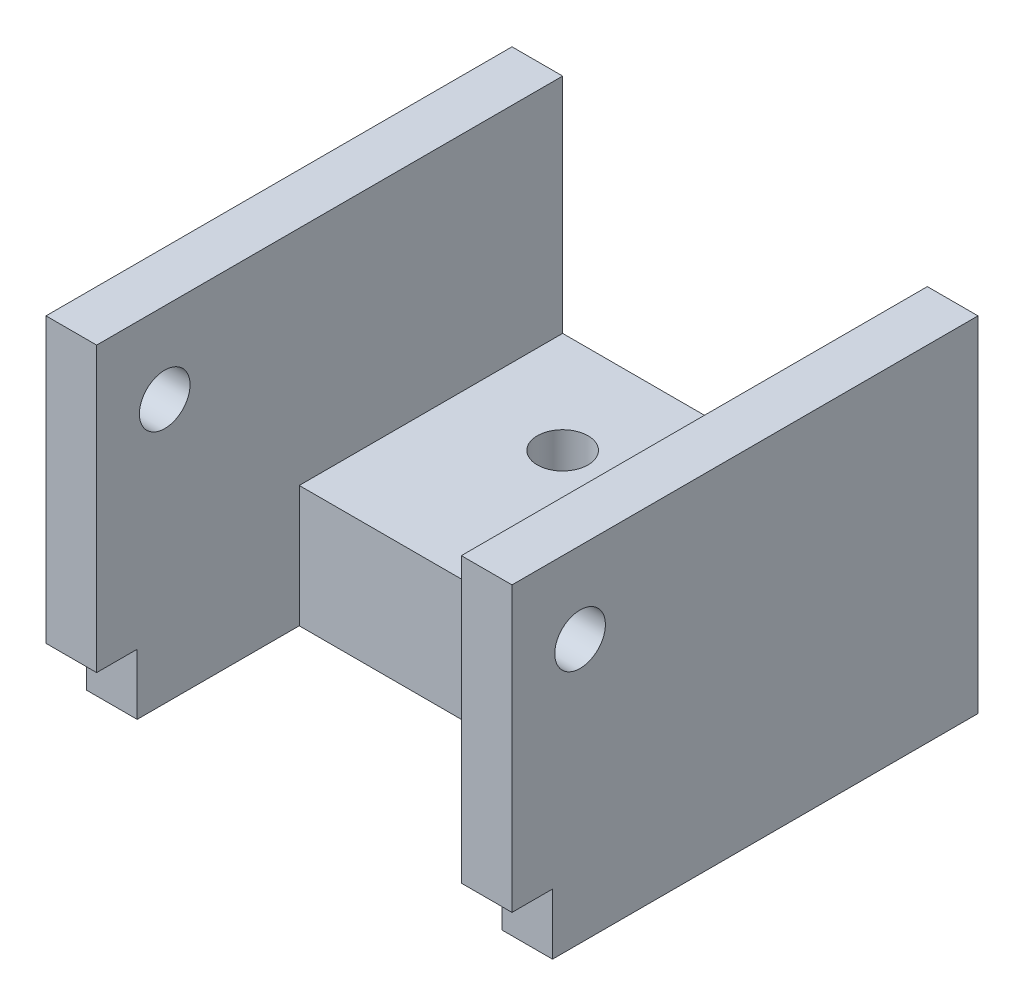
ISO-10303-21;
HEADER;
FILE_DESCRIPTION(('STEP AP214'),'2;1');
FILE_NAME('part.step','',(''),(''),'','','');
FILE_SCHEMA(('AUTOMOTIVE_DESIGN { 1 0 10303 214 1 1 1 1 }'));
ENDSEC;
DATA;
#1=APPLICATION_CONTEXT('core data for automotive mechanical design processes');
#2=APPLICATION_PROTOCOL_DEFINITION('international standard','automotive_design',2000,#1);
#3=PRODUCT_CONTEXT('',#1,'mechanical');
#4=PRODUCT('Part','Part','',(#3));
#5=PRODUCT_RELATED_PRODUCT_CATEGORY('part','',(#4));
#6=PRODUCT_DEFINITION_FORMATION('','',#4);
#7=PRODUCT_DEFINITION_CONTEXT('part definition',#1,'design');
#8=PRODUCT_DEFINITION('design','',#6,#7);
#9=PRODUCT_DEFINITION_SHAPE('','',#8);
#10=(LENGTH_UNIT() NAMED_UNIT(*) SI_UNIT(.MILLI.,.METRE.));
#11=(NAMED_UNIT(*) PLANE_ANGLE_UNIT() SI_UNIT($,.RADIAN.));
#12=(NAMED_UNIT(*) SI_UNIT($,.STERADIAN.) SOLID_ANGLE_UNIT());
#13=UNCERTAINTY_MEASURE_WITH_UNIT(LENGTH_MEASURE(1.E-05),#10,'distance_accuracy_value','');
#14=(GEOMETRIC_REPRESENTATION_CONTEXT(3) GLOBAL_UNCERTAINTY_ASSIGNED_CONTEXT((#13)) GLOBAL_UNIT_ASSIGNED_CONTEXT((#10,
#11,#12)) REPRESENTATION_CONTEXT('',''));
#15=CARTESIAN_POINT('',(0.,0.,0.));
#16=DIRECTION('',(0.,0.,1.));
#17=DIRECTION('',(1.,0.,0.));
#18=AXIS2_PLACEMENT_3D('',#15,#16,#17);
#19=CARTESIAN_POINT('',(2.5,32.3470437172241,50.9710991907774));
#20=DIRECTION('',(0.,0.,-1.));
#21=DIRECTION('',(0.,1.,0.));
#22=AXIS2_PLACEMENT_3D('',#19,#20,#21);
#23=PLANE('',#22);
#24=DIRECTION('',(0.,-1.,0.));
#25=VECTOR('',#24,1.);
#26=CARTESIAN_POINT('',(0.,32.3470437172241,50.9710991907774));
#27=LINE('',#26,#25);
#28=CARTESIAN_POINT('',(0.,32.3470437172241,50.9710991907774));
#29=VERTEX_POINT('',#28);
#30=CARTESIAN_POINT('',(0.,18.3470437172241,50.9710991907774));
#31=VERTEX_POINT('',#30);
#32=EDGE_CURVE('E159',#29,#31,#27,.T.);
#33=ORIENTED_EDGE('',*,*,#32,.T.);
#34=DIRECTION('',(1.,0.,0.));
#35=VECTOR('',#34,1.);
#36=CARTESIAN_POINT('',(0.,18.3470437172241,50.9710991907774));
#37=LINE('',#36,#35);
#38=CARTESIAN_POINT('',(2.5,18.3470437172241,50.9710991907774));
#39=VERTEX_POINT('',#38);
#40=EDGE_CURVE('E198',#31,#39,#37,.T.);
#41=ORIENTED_EDGE('',*,*,#40,.T.);
#42=DIRECTION('',(0.,-1.,0.));
#43=VECTOR('',#42,1.);
#44=CARTESIAN_POINT('',(2.5,32.3470437172241,50.9710991907774));
#45=LINE('',#44,#43);
#46=CARTESIAN_POINT('',(2.5,32.3470437172241,50.9710991907774));
#47=VERTEX_POINT('',#46);
#48=EDGE_CURVE('E169',#47,#39,#45,.T.);
#49=ORIENTED_EDGE('',*,*,#48,.F.);
#50=DIRECTION('',(-1.,0.,0.));
#51=VECTOR('',#50,1.);
#52=CARTESIAN_POINT('',(2.5,32.3470437172241,50.9710991907774));
#53=LINE('',#52,#51);
#54=EDGE_CURVE('E170',#47,#29,#53,.T.);
#55=ORIENTED_EDGE('',*,*,#54,.T.);
#56=EDGE_LOOP('',(#33,#41,#49,#55));
#57=FACE_BOUND('',#56,.T.);
#58=ADVANCED_FACE('F32',(#57),#23,.F.);
#59=CARTESIAN_POINT('',(2.5,15.3470437172241,50.9710991907774));
#60=DIRECTION('',(0.,1.,0.));
#61=DIRECTION('',(0.,0.,1.));
#62=AXIS2_PLACEMENT_3D('',#59,#60,#61);
#63=PLANE('',#62);
#64=CARTESIAN_POINT('',(15.5,15.3470437172241,32.9710991907774));
#65=DIRECTION('',(0.,1.,0.));
#66=DIRECTION('',(0.,0.,1.));
#67=AXIS2_PLACEMENT_3D('',#64,#65,#66);
#68=CIRCLE('',#67,1.25);
#69=CARTESIAN_POINT('',(15.5,15.3470437172241,34.2210991907774));
#70=VERTEX_POINT('',#69);
#71=EDGE_CURVE('E378',#70,#70,#68,.T.);
#72=ORIENTED_EDGE('',*,*,#71,.T.);
#73=EDGE_LOOP('',(#72));
#74=FACE_BOUND('',#73,.T.);
#75=CARTESIAN_POINT('',(7.5,15.3470437172241,32.9710991907774));
#76=DIRECTION('',(0.,1.,0.));
#77=DIRECTION('',(0.,0.,1.));
#78=AXIS2_PLACEMENT_3D('',#75,#76,#77);
#79=CIRCLE('',#78,1.25);
#80=CARTESIAN_POINT('',(7.5,15.3470437172241,34.2210991907774));
#81=VERTEX_POINT('',#80);
#82=EDGE_CURVE('E382',#81,#81,#79,.T.);
#83=ORIENTED_EDGE('',*,*,#82,.T.);
#84=EDGE_LOOP('',(#83));
#85=FACE_BOUND('',#84,.T.);
#86=DIRECTION('',(0.,0.,-1.));
#87=VECTOR('',#86,1.);
#88=CARTESIAN_POINT('',(23.,15.3470437172241,27.9710991907774));
#89=LINE('',#88,#87);
#90=CARTESIAN_POINT('',(23.,15.3470437172241,48.9710991907774));
#91=VERTEX_POINT('',#90);
#92=CARTESIAN_POINT('',(23.,15.3470437172241,27.9710991907774));
#93=VERTEX_POINT('',#92);
#94=EDGE_CURVE('E237',#91,#93,#89,.T.);
#95=ORIENTED_EDGE('',*,*,#94,.F.);
#96=DIRECTION('',(1.,0.,0.));
#97=VECTOR('',#96,1.);
#98=CARTESIAN_POINT('',(0.,15.3470437172241,48.9710991907774));
#99=LINE('',#98,#97);
#100=CARTESIAN_POINT('',(20.5,15.3470437172241,48.9710991907774));
#101=VERTEX_POINT('',#100);
#102=EDGE_CURVE('E57',#101,#91,#99,.T.);
#103=ORIENTED_EDGE('',*,*,#102,.F.);
#104=DIRECTION('',(0.,0.,-1.));
#105=VECTOR('',#104,1.);
#106=CARTESIAN_POINT('',(20.5,15.3470437172241,27.9710991907774));
#107=LINE('',#106,#105);
#108=CARTESIAN_POINT('',(20.5,15.3470437172241,40.9710991907774));
#109=VERTEX_POINT('',#108);
#110=EDGE_CURVE('E225',#101,#109,#107,.T.);
#111=ORIENTED_EDGE('',*,*,#110,.T.);
#112=DIRECTION('',(-1.,0.,0.));
#113=VECTOR('',#112,1.);
#114=CARTESIAN_POINT('',(20.5,15.3470437172241,40.9710991907774));
#115=LINE('',#114,#113);
#116=CARTESIAN_POINT('',(2.5,15.3470437172241,40.9710991907774));
#117=VERTEX_POINT('',#116);
#118=EDGE_CURVE('E203',#109,#117,#115,.T.);
#119=ORIENTED_EDGE('',*,*,#118,.T.);
#120=DIRECTION('',(0.,0.,-1.));
#121=VECTOR('',#120,1.);
#122=CARTESIAN_POINT('',(2.5,15.3470437172241,50.9710991907774));
#123=LINE('',#122,#121);
#124=CARTESIAN_POINT('',(2.5,15.3470437172241,48.9710991907774));
#125=VERTEX_POINT('',#124);
#126=EDGE_CURVE('E35',#125,#117,#123,.T.);
#127=ORIENTED_EDGE('',*,*,#126,.F.);
#128=CARTESIAN_POINT('',(0.,15.3470437172241,48.9710991907774));
#129=VERTEX_POINT('',#128);
#130=EDGE_CURVE('E139',#129,#125,#99,.T.);
#131=ORIENTED_EDGE('',*,*,#130,.F.);
#132=DIRECTION('',(0.,0.,-1.));
#133=VECTOR('',#132,1.);
#134=CARTESIAN_POINT('',(0.,15.3470437172241,50.9710991907774));
#135=LINE('',#134,#133);
#136=CARTESIAN_POINT('',(0.,15.3470437172241,27.9710991907774));
#137=VERTEX_POINT('',#136);
#138=EDGE_CURVE('E151',#129,#137,#135,.T.);
#139=ORIENTED_EDGE('',*,*,#138,.T.);
#140=DIRECTION('',(-1.,0.,0.));
#141=VECTOR('',#140,1.);
#142=CARTESIAN_POINT('',(2.5,15.3470437172241,27.9710991907774));
#143=LINE('',#142,#141);
#144=EDGE_CURVE('E11',#93,#137,#143,.T.);
#145=ORIENTED_EDGE('',*,*,#144,.F.);
#146=EDGE_LOOP('',(#95,#103,#111,#119,#127,#131,#139,#145));
#147=FACE_BOUND('',#146,.T.);
#148=ADVANCED_FACE('F149',(#74,#85,#147),#63,.F.);
#149=CARTESIAN_POINT('',(2.5,32.3470437172241,27.9710991907774));
#150=DIRECTION('',(0.,0.,1.));
#151=DIRECTION('',(0.,-1.,0.));
#152=AXIS2_PLACEMENT_3D('',#149,#150,#151);
#153=PLANE('',#152);
#154=DIRECTION('',(0.,1.,0.));
#155=VECTOR('',#154,1.);
#156=CARTESIAN_POINT('',(0.,32.3470437172241,27.9710991907774));
#157=LINE('',#156,#155);
#158=CARTESIAN_POINT('',(0.,32.3470437172241,27.9710991907774));
#159=VERTEX_POINT('',#158);
#160=EDGE_CURVE('E158',#137,#159,#157,.T.);
#161=ORIENTED_EDGE('',*,*,#160,.T.);
#162=DIRECTION('',(-1.,0.,0.));
#163=VECTOR('',#162,1.);
#164=CARTESIAN_POINT('',(2.5,32.3470437172241,27.9710991907774));
#165=LINE('',#164,#163);
#166=CARTESIAN_POINT('',(2.5,32.3470437172241,27.9710991907774));
#167=VERTEX_POINT('',#166);
#168=EDGE_CURVE('E41',#167,#159,#165,.T.);
#169=ORIENTED_EDGE('',*,*,#168,.F.);
#170=DIRECTION('',(0.,1.,0.));
#171=VECTOR('',#170,1.);
#172=CARTESIAN_POINT('',(2.5,32.3470437172241,27.9710991907774));
#173=LINE('',#172,#171);
#174=CARTESIAN_POINT('',(2.5,21.3470437172241,27.9710991907774));
#175=VERTEX_POINT('',#174);
#176=EDGE_CURVE('E176',#175,#167,#173,.T.);
#177=ORIENTED_EDGE('',*,*,#176,.F.);
#178=DIRECTION('',(-1.,0.,0.));
#179=VECTOR('',#178,1.);
#180=CARTESIAN_POINT('',(20.5,21.3470437172241,27.9710991907774));
#181=LINE('',#180,#179);
#182=CARTESIAN_POINT('',(20.5,21.3470437172241,27.9710991907774));
#183=VERTEX_POINT('',#182);
#184=EDGE_CURVE('E164',#183,#175,#181,.T.);
#185=ORIENTED_EDGE('',*,*,#184,.F.);
#186=DIRECTION('',(0.,1.,0.));
#187=VECTOR('',#186,1.);
#188=CARTESIAN_POINT('',(20.5,15.3470437172241,27.9710991907774));
#189=LINE('',#188,#187);
#190=CARTESIAN_POINT('',(20.5,32.3470437172241,27.9710991907774));
#191=VERTEX_POINT('',#190);
#192=EDGE_CURVE('E239',#183,#191,#189,.T.);
#193=ORIENTED_EDGE('',*,*,#192,.T.);
#194=DIRECTION('',(-1.,0.,0.));
#195=VECTOR('',#194,1.);
#196=CARTESIAN_POINT('',(23.,32.3470437172241,27.9710991907774));
#197=LINE('',#196,#195);
#198=CARTESIAN_POINT('',(23.,32.3470437172241,27.9710991907774));
#199=VERTEX_POINT('',#198);
#200=EDGE_CURVE('E236',#199,#191,#197,.T.);
#201=ORIENTED_EDGE('',*,*,#200,.F.);
#202=DIRECTION('',(0.,1.,0.));
#203=VECTOR('',#202,1.);
#204=CARTESIAN_POINT('',(23.,15.3470437172241,27.9710991907774));
#205=LINE('',#204,#203);
#206=EDGE_CURVE('E227',#93,#199,#205,.T.);
#207=ORIENTED_EDGE('',*,*,#206,.F.);
#208=ORIENTED_EDGE('',*,*,#144,.T.);
#209=EDGE_LOOP('',(#161,#169,#177,#185,#193,#201,#207,#208));
#210=FACE_BOUND('',#209,.T.);
#211=ADVANCED_FACE('F284',(#210),#153,.F.);
#212=CARTESIAN_POINT('',(2.5,32.3470437172241,50.9710991907774));
#213=DIRECTION('',(0.,-1.,0.));
#214=DIRECTION('',(0.,0.,-1.));
#215=AXIS2_PLACEMENT_3D('',#212,#213,#214);
#216=PLANE('',#215);
#217=DIRECTION('',(0.,0.,1.));
#218=VECTOR('',#217,1.);
#219=CARTESIAN_POINT('',(0.,32.3470437172241,50.9710991907774));
#220=LINE('',#219,#218);
#221=EDGE_CURVE('E161',#159,#29,#220,.T.);
#222=ORIENTED_EDGE('',*,*,#221,.T.);
#223=ORIENTED_EDGE('',*,*,#54,.F.);
#224=DIRECTION('',(0.,0.,1.));
#225=VECTOR('',#224,1.);
#226=CARTESIAN_POINT('',(2.5,32.3470437172241,50.9710991907774));
#227=LINE('',#226,#225);
#228=EDGE_CURVE('E173',#167,#47,#227,.T.);
#229=ORIENTED_EDGE('',*,*,#228,.F.);
#230=ORIENTED_EDGE('',*,*,#168,.T.);
#231=EDGE_LOOP('',(#222,#223,#229,#230));
#232=FACE_BOUND('',#231,.T.);
#233=ADVANCED_FACE('F194',(#232),#216,.F.);
#234=CARTESIAN_POINT('',(2.5,0.,0.));
#235=DIRECTION('',(1.,0.,0.));
#236=DIRECTION('',(0.,0.,-1.));
#237=AXIS2_PLACEMENT_3D('',#234,#235,#236);
#238=PLANE('',#237);
#239=CARTESIAN_POINT('',(2.5,28.3470437172241,47.6110991907774));
#240=DIRECTION('',(1.,0.,0.));
#241=DIRECTION('',(0.,0.,-1.));
#242=AXIS2_PLACEMENT_3D('',#239,#240,#241);
#243=CIRCLE('',#242,1.25);
#244=CARTESIAN_POINT('',(2.5,28.3470437172241,46.3610991907774));
#245=VERTEX_POINT('',#244);
#246=EDGE_CURVE('E335',#245,#245,#243,.T.);
#247=ORIENTED_EDGE('',*,*,#246,.F.);
#248=EDGE_LOOP('',(#247));
#249=FACE_BOUND('',#248,.T.);
#250=DIRECTION('',(0.,0.,1.));
#251=VECTOR('',#250,1.);
#252=CARTESIAN_POINT('',(2.5,18.3470437172241,0.));
#253=LINE('',#252,#251);
#254=CARTESIAN_POINT('',(2.5,18.3470437172241,48.9710991907774));
#255=VERTEX_POINT('',#254);
#256=EDGE_CURVE('E242',#255,#39,#253,.T.);
#257=ORIENTED_EDGE('',*,*,#256,.F.);
#258=DIRECTION('',(0.,1.,0.));
#259=VECTOR('',#258,1.);
#260=CARTESIAN_POINT('',(2.5,0.,48.9710991907774));
#261=LINE('',#260,#259);
#262=EDGE_CURVE('E267',#125,#255,#261,.T.);
#263=ORIENTED_EDGE('',*,*,#262,.F.);
#264=ORIENTED_EDGE('',*,*,#126,.T.);
#265=DIRECTION('',(0.,-1.,0.));
#266=VECTOR('',#265,1.);
#267=CARTESIAN_POINT('',(2.5,15.3470437172241,40.9710991907774));
#268=LINE('',#267,#266);
#269=CARTESIAN_POINT('',(2.5,21.3470437172241,40.9710991907774));
#270=VERTEX_POINT('',#269);
#271=EDGE_CURVE('E209',#270,#117,#268,.T.);
#272=ORIENTED_EDGE('',*,*,#271,.F.);
#273=DIRECTION('',(0.,0.,1.));
#274=VECTOR('',#273,1.);
#275=CARTESIAN_POINT('',(2.5,21.3470437172241,27.9710991907774));
#276=LINE('',#275,#274);
#277=EDGE_CURVE('E179',#175,#270,#276,.T.);
#278=ORIENTED_EDGE('',*,*,#277,.F.);
#279=ORIENTED_EDGE('',*,*,#176,.T.);
#280=ORIENTED_EDGE('',*,*,#228,.T.);
#281=ORIENTED_EDGE('',*,*,#48,.T.);
#282=EDGE_LOOP('',(#257,#263,#264,#272,#278,#279,#280,#281));
#283=FACE_BOUND('',#282,.T.);
#284=ADVANCED_FACE('F189',(#249,#283),#238,.T.);
#285=CARTESIAN_POINT('',(0.,0.,0.));
#286=DIRECTION('',(1.,0.,0.));
#287=DIRECTION('',(0.,0.,-1.));
#288=AXIS2_PLACEMENT_3D('',#285,#286,#287);
#289=PLANE('',#288);
#290=CARTESIAN_POINT('',(0.,28.3470437172241,47.6110991907774));
#291=DIRECTION('',(1.,0.,0.));
#292=DIRECTION('',(0.,0.,-1.));
#293=AXIS2_PLACEMENT_3D('',#290,#291,#292);
#294=CIRCLE('',#293,1.25);
#295=CARTESIAN_POINT('',(0.,28.3470437172241,46.3610991907774));
#296=VERTEX_POINT('',#295);
#297=EDGE_CURVE('E389',#296,#296,#294,.T.);
#298=ORIENTED_EDGE('',*,*,#297,.T.);
#299=EDGE_LOOP('',(#298));
#300=FACE_BOUND('',#299,.T.);
#301=DIRECTION('',(0.,1.,0.));
#302=VECTOR('',#301,1.);
#303=CARTESIAN_POINT('',(0.,15.3470437172241,48.9710991907774));
#304=LINE('',#303,#302);
#305=CARTESIAN_POINT('',(0.,18.3470437172241,48.9710991907774));
#306=VERTEX_POINT('',#305);
#307=EDGE_CURVE('E136',#129,#306,#304,.T.);
#308=ORIENTED_EDGE('',*,*,#307,.T.);
#309=DIRECTION('',(0.,0.,1.));
#310=VECTOR('',#309,1.);
#311=CARTESIAN_POINT('',(0.,18.3470437172241,50.9710991907774));
#312=LINE('',#311,#310);
#313=EDGE_CURVE('E49',#306,#31,#312,.T.);
#314=ORIENTED_EDGE('',*,*,#313,.T.);
#315=ORIENTED_EDGE('',*,*,#32,.F.);
#316=ORIENTED_EDGE('',*,*,#221,.F.);
#317=ORIENTED_EDGE('',*,*,#160,.F.);
#318=ORIENTED_EDGE('',*,*,#138,.F.);
#319=EDGE_LOOP('',(#308,#314,#315,#316,#317,#318));
#320=FACE_BOUND('',#319,.T.);
#321=ADVANCED_FACE('F156',(#300,#320),#289,.F.);
#322=CARTESIAN_POINT('',(20.5,21.3470437172241,27.9710991907774));
#323=DIRECTION('',(0.,-1.,0.));
#324=DIRECTION('',(0.,0.,-1.));
#325=AXIS2_PLACEMENT_3D('',#322,#323,#324);
#326=PLANE('',#325);
#327=CARTESIAN_POINT('',(15.5,21.3470437172241,32.9710991907774));
#328=DIRECTION('',(0.,1.,0.));
#329=DIRECTION('',(0.,0.,1.));
#330=AXIS2_PLACEMENT_3D('',#327,#328,#329);
#331=CIRCLE('',#330,1.25);
#332=CARTESIAN_POINT('',(15.5,21.3470437172241,34.2210991907774));
#333=VERTEX_POINT('',#332);
#334=EDGE_CURVE('E376',#333,#333,#331,.T.);
#335=ORIENTED_EDGE('',*,*,#334,.F.);
#336=EDGE_LOOP('',(#335));
#337=FACE_BOUND('',#336,.T.);
#338=CARTESIAN_POINT('',(7.5,21.3470437172241,32.9710991907774));
#339=DIRECTION('',(0.,1.,0.));
#340=DIRECTION('',(0.,0.,1.));
#341=AXIS2_PLACEMENT_3D('',#338,#339,#340);
#342=CIRCLE('',#341,1.25);
#343=CARTESIAN_POINT('',(7.5,21.3470437172241,34.2210991907774));
#344=VERTEX_POINT('',#343);
#345=EDGE_CURVE('E379',#344,#344,#342,.T.);
#346=ORIENTED_EDGE('',*,*,#345,.F.);
#347=EDGE_LOOP('',(#346));
#348=FACE_BOUND('',#347,.T.);
#349=ORIENTED_EDGE('',*,*,#277,.T.);
#350=DIRECTION('',(-1.,0.,0.));
#351=VECTOR('',#350,1.);
#352=CARTESIAN_POINT('',(20.5,21.3470437172241,40.9710991907774));
#353=LINE('',#352,#351);
#354=CARTESIAN_POINT('',(20.5,21.3470437172241,40.9710991907774));
#355=VERTEX_POINT('',#354);
#356=EDGE_CURVE('E200',#355,#270,#353,.T.);
#357=ORIENTED_EDGE('',*,*,#356,.F.);
#358=DIRECTION('',(0.,0.,1.));
#359=VECTOR('',#358,1.);
#360=CARTESIAN_POINT('',(20.5,21.3470437172241,27.9710991907774));
#361=LINE('',#360,#359);
#362=EDGE_CURVE('E213',#183,#355,#361,.T.);
#363=ORIENTED_EDGE('',*,*,#362,.F.);
#364=ORIENTED_EDGE('',*,*,#184,.T.);
#365=EDGE_LOOP('',(#349,#357,#363,#364));
#366=FACE_BOUND('',#365,.T.);
#367=ADVANCED_FACE('F314',(#337,#348,#366),#326,.F.);
#368=CARTESIAN_POINT('',(20.5,15.3470437172241,40.9710991907774));
#369=DIRECTION('',(0.,0.,-1.));
#370=DIRECTION('',(-1.,0.,0.));
#371=AXIS2_PLACEMENT_3D('',#368,#369,#370);
#372=PLANE('',#371);
#373=ORIENTED_EDGE('',*,*,#271,.T.);
#374=ORIENTED_EDGE('',*,*,#118,.F.);
#375=DIRECTION('',(0.,-1.,0.));
#376=VECTOR('',#375,1.);
#377=CARTESIAN_POINT('',(20.5,15.3470437172241,40.9710991907774));
#378=LINE('',#377,#376);
#379=EDGE_CURVE('E217',#355,#109,#378,.T.);
#380=ORIENTED_EDGE('',*,*,#379,.F.);
#381=ORIENTED_EDGE('',*,*,#356,.T.);
#382=EDGE_LOOP('',(#373,#374,#380,#381));
#383=FACE_BOUND('',#382,.T.);
#384=ADVANCED_FACE('F294',(#383),#372,.F.);
#385=CARTESIAN_POINT('',(20.5,0.,0.));
#386=DIRECTION('',(1.,0.,0.));
#387=DIRECTION('',(0.,0.,-1.));
#388=AXIS2_PLACEMENT_3D('',#385,#386,#387);
#389=PLANE('',#388);
#390=CARTESIAN_POINT('',(20.5,28.3470437172241,47.6110991907774));
#391=DIRECTION('',(1.,0.,0.));
#392=DIRECTION('',(0.,0.,-1.));
#393=AXIS2_PLACEMENT_3D('',#390,#391,#392);
#394=CIRCLE('',#393,1.25);
#395=CARTESIAN_POINT('',(20.5,28.3470437172241,46.3610991907774));
#396=VERTEX_POINT('',#395);
#397=EDGE_CURVE('E392',#396,#396,#394,.T.);
#398=ORIENTED_EDGE('',*,*,#397,.T.);
#399=EDGE_LOOP('',(#398));
#400=FACE_BOUND('',#399,.T.);
#401=DIRECTION('',(0.,1.,0.));
#402=VECTOR('',#401,1.);
#403=CARTESIAN_POINT('',(20.5,0.,48.9710991907774));
#404=LINE('',#403,#402);
#405=CARTESIAN_POINT('',(20.5,18.3470437172241,48.9710991907774));
#406=VERTEX_POINT('',#405);
#407=EDGE_CURVE('E264',#101,#406,#404,.T.);
#408=ORIENTED_EDGE('',*,*,#407,.T.);
#409=DIRECTION('',(0.,0.,1.));
#410=VECTOR('',#409,1.);
#411=CARTESIAN_POINT('',(20.5,18.3470437172241,0.));
#412=LINE('',#411,#410);
#413=CARTESIAN_POINT('',(20.5,18.3470437172241,50.9710991907774));
#414=VERTEX_POINT('',#413);
#415=EDGE_CURVE('E262',#406,#414,#412,.T.);
#416=ORIENTED_EDGE('',*,*,#415,.T.);
#417=DIRECTION('',(0.,-1.,0.));
#418=VECTOR('',#417,1.);
#419=CARTESIAN_POINT('',(20.5,15.3470437172241,50.9710991907774));
#420=LINE('',#419,#418);
#421=CARTESIAN_POINT('',(20.5,32.3470437172241,50.9710991907774));
#422=VERTEX_POINT('',#421);
#423=EDGE_CURVE('E228',#422,#414,#420,.T.);
#424=ORIENTED_EDGE('',*,*,#423,.F.);
#425=DIRECTION('',(0.,0.,1.));
#426=VECTOR('',#425,1.);
#427=CARTESIAN_POINT('',(20.5,32.3470437172241,27.9710991907774));
#428=LINE('',#427,#426);
#429=EDGE_CURVE('E241',#191,#422,#428,.T.);
#430=ORIENTED_EDGE('',*,*,#429,.F.);
#431=ORIENTED_EDGE('',*,*,#192,.F.);
#432=ORIENTED_EDGE('',*,*,#362,.T.);
#433=ORIENTED_EDGE('',*,*,#379,.T.);
#434=ORIENTED_EDGE('',*,*,#110,.F.);
#435=EDGE_LOOP('',(#408,#416,#424,#430,#431,#432,#433,#434));
#436=FACE_BOUND('',#435,.T.);
#437=ADVANCED_FACE('F260',(#400,#436),#389,.F.);
#438=CARTESIAN_POINT('',(23.,32.3470437172241,27.9710991907774));
#439=DIRECTION('',(0.,-1.,0.));
#440=DIRECTION('',(0.,0.,-1.));
#441=AXIS2_PLACEMENT_3D('',#438,#439,#440);
#442=PLANE('',#441);
#443=ORIENTED_EDGE('',*,*,#429,.T.);
#444=DIRECTION('',(-1.,0.,0.));
#445=VECTOR('',#444,1.);
#446=CARTESIAN_POINT('',(23.,32.3470437172241,50.9710991907774));
#447=LINE('',#446,#445);
#448=CARTESIAN_POINT('',(23.,32.3470437172241,50.9710991907774));
#449=VERTEX_POINT('',#448);
#450=EDGE_CURVE('E233',#449,#422,#447,.T.);
#451=ORIENTED_EDGE('',*,*,#450,.F.);
#452=DIRECTION('',(0.,0.,1.));
#453=VECTOR('',#452,1.);
#454=CARTESIAN_POINT('',(23.,32.3470437172241,27.9710991907774));
#455=LINE('',#454,#453);
#456=EDGE_CURVE('E275',#199,#449,#455,.T.);
#457=ORIENTED_EDGE('',*,*,#456,.F.);
#458=ORIENTED_EDGE('',*,*,#200,.T.);
#459=EDGE_LOOP('',(#443,#451,#457,#458));
#460=FACE_BOUND('',#459,.T.);
#461=ADVANCED_FACE('F286',(#460),#442,.F.);
#462=CARTESIAN_POINT('',(23.,15.3470437172241,50.9710991907774));
#463=DIRECTION('',(0.,0.,-1.));
#464=DIRECTION('',(-1.,0.,0.));
#465=AXIS2_PLACEMENT_3D('',#462,#463,#464);
#466=PLANE('',#465);
#467=ORIENTED_EDGE('',*,*,#423,.T.);
#468=CARTESIAN_POINT('',(23.,18.3470437172241,50.9710991907774));
#469=VERTEX_POINT('',#468);
#470=EDGE_CURVE('E255',#414,#469,#37,.T.);
#471=ORIENTED_EDGE('',*,*,#470,.T.);
#472=DIRECTION('',(0.,-1.,0.));
#473=VECTOR('',#472,1.);
#474=CARTESIAN_POINT('',(23.,15.3470437172241,50.9710991907774));
#475=LINE('',#474,#473);
#476=EDGE_CURVE('E276',#449,#469,#475,.T.);
#477=ORIENTED_EDGE('',*,*,#476,.F.);
#478=ORIENTED_EDGE('',*,*,#450,.T.);
#479=EDGE_LOOP('',(#467,#471,#477,#478));
#480=FACE_BOUND('',#479,.T.);
#481=ADVANCED_FACE('F253',(#480),#466,.F.);
#482=CARTESIAN_POINT('',(23.,0.,0.));
#483=DIRECTION('',(1.,0.,0.));
#484=DIRECTION('',(0.,0.,-1.));
#485=AXIS2_PLACEMENT_3D('',#482,#483,#484);
#486=PLANE('',#485);
#487=CARTESIAN_POINT('',(23.,28.3470437172241,47.6110991907774));
#488=DIRECTION('',(1.,0.,0.));
#489=DIRECTION('',(0.,0.,-1.));
#490=AXIS2_PLACEMENT_3D('',#487,#488,#489);
#491=CIRCLE('',#490,1.25);
#492=CARTESIAN_POINT('',(23.,28.3470437172241,46.3610991907774));
#493=VERTEX_POINT('',#492);
#494=EDGE_CURVE('E388',#493,#493,#491,.T.);
#495=ORIENTED_EDGE('',*,*,#494,.F.);
#496=EDGE_LOOP('',(#495));
#497=FACE_BOUND('',#496,.T.);
#498=DIRECTION('',(0.,0.,1.));
#499=VECTOR('',#498,1.);
#500=CARTESIAN_POINT('',(23.,18.3470437172241,50.9710991907774));
#501=LINE('',#500,#499);
#502=CARTESIAN_POINT('',(23.,18.3470437172241,48.9710991907774));
#503=VERTEX_POINT('',#502);
#504=EDGE_CURVE('E144',#503,#469,#501,.T.);
#505=ORIENTED_EDGE('',*,*,#504,.F.);
#506=DIRECTION('',(0.,1.,0.));
#507=VECTOR('',#506,1.);
#508=CARTESIAN_POINT('',(23.,15.3470437172241,48.9710991907774));
#509=LINE('',#508,#507);
#510=EDGE_CURVE('E282',#91,#503,#509,.T.);
#511=ORIENTED_EDGE('',*,*,#510,.F.);
#512=ORIENTED_EDGE('',*,*,#94,.T.);
#513=ORIENTED_EDGE('',*,*,#206,.T.);
#514=ORIENTED_EDGE('',*,*,#456,.T.);
#515=ORIENTED_EDGE('',*,*,#476,.T.);
#516=EDGE_LOOP('',(#505,#511,#512,#513,#514,#515));
#517=FACE_BOUND('',#516,.T.);
#518=ADVANCED_FACE('F279',(#497,#517),#486,.T.);
#519=CARTESIAN_POINT('',(0.,15.3470437172241,48.9710991907774));
#520=DIRECTION('',(0.,0.,-1.));
#521=DIRECTION('',(-1.,0.,0.));
#522=AXIS2_PLACEMENT_3D('',#519,#520,#521);
#523=PLANE('',#522);
#524=ORIENTED_EDGE('',*,*,#102,.T.);
#525=ORIENTED_EDGE('',*,*,#510,.T.);
#526=DIRECTION('',(1.,0.,0.));
#527=VECTOR('',#526,1.);
#528=CARTESIAN_POINT('',(0.,18.3470437172241,48.9710991907774));
#529=LINE('',#528,#527);
#530=EDGE_CURVE('E153',#406,#503,#529,.T.);
#531=ORIENTED_EDGE('',*,*,#530,.F.);
#532=ORIENTED_EDGE('',*,*,#407,.F.);
#533=EDGE_LOOP('',(#524,#525,#531,#532));
#534=FACE_BOUND('',#533,.T.);
#535=ADVANCED_FACE('F339',(#534),#523,.F.);
#536=CARTESIAN_POINT('',(0.,18.3470437172241,50.9710991907774));
#537=DIRECTION('',(0.,1.,0.));
#538=DIRECTION('',(0.,0.,1.));
#539=AXIS2_PLACEMENT_3D('',#536,#537,#538);
#540=PLANE('',#539);
#541=ORIENTED_EDGE('',*,*,#530,.T.);
#542=ORIENTED_EDGE('',*,*,#504,.T.);
#543=ORIENTED_EDGE('',*,*,#470,.F.);
#544=ORIENTED_EDGE('',*,*,#415,.F.);
#545=EDGE_LOOP('',(#541,#542,#543,#544));
#546=FACE_BOUND('',#545,.T.);
#547=ADVANCED_FACE('F338',(#546),#540,.F.);
#548=ORIENTED_EDGE('',*,*,#256,.T.);
#549=ORIENTED_EDGE('',*,*,#40,.F.);
#550=ORIENTED_EDGE('',*,*,#313,.F.);
#551=EDGE_CURVE('E141',#306,#255,#529,.T.);
#552=ORIENTED_EDGE('',*,*,#551,.T.);
#553=EDGE_LOOP('',(#548,#549,#550,#552));
#554=FACE_BOUND('',#553,.T.);
#555=ADVANCED_FACE('F346',(#554),#540,.F.);
#556=ORIENTED_EDGE('',*,*,#262,.T.);
#557=ORIENTED_EDGE('',*,*,#551,.F.);
#558=ORIENTED_EDGE('',*,*,#307,.F.);
#559=ORIENTED_EDGE('',*,*,#130,.T.);
#560=EDGE_LOOP('',(#556,#557,#558,#559));
#561=FACE_BOUND('',#560,.T.);
#562=ADVANCED_FACE('F138',(#561),#523,.F.);
#563=CARTESIAN_POINT('',(0.,28.3470437172241,47.6110991907774));
#564=DIRECTION('',(1.,0.,0.));
#565=DIRECTION('',(0.,0.,-1.));
#566=AXIS2_PLACEMENT_3D('',#563,#564,#565);
#567=CYLINDRICAL_SURFACE('',#566,1.25);
#568=ORIENTED_EDGE('',*,*,#494,.T.);
#569=EDGE_LOOP('',(#568));
#570=FACE_BOUND('',#569,.T.);
#571=ORIENTED_EDGE('',*,*,#397,.F.);
#572=EDGE_LOOP('',(#571));
#573=FACE_BOUND('',#572,.T.);
#574=ADVANCED_FACE('F351',(#570,#573),#567,.F.);
#575=ORIENTED_EDGE('',*,*,#246,.T.);
#576=EDGE_LOOP('',(#575));
#577=FACE_BOUND('',#576,.T.);
#578=ORIENTED_EDGE('',*,*,#297,.F.);
#579=EDGE_LOOP('',(#578));
#580=FACE_BOUND('',#579,.T.);
#581=ADVANCED_FACE('F356',(#577,#580),#567,.F.);
#582=CARTESIAN_POINT('',(7.5,11.3470437172241,32.9710991907774));
#583=DIRECTION('',(0.,1.,0.));
#584=DIRECTION('',(0.,0.,1.));
#585=AXIS2_PLACEMENT_3D('',#582,#583,#584);
#586=CYLINDRICAL_SURFACE('',#585,1.25);
#587=ORIENTED_EDGE('',*,*,#345,.T.);
#588=EDGE_LOOP('',(#587));
#589=FACE_BOUND('',#588,.T.);
#590=ORIENTED_EDGE('',*,*,#82,.F.);
#591=EDGE_LOOP('',(#590));
#592=FACE_BOUND('',#591,.T.);
#593=ADVANCED_FACE('F363',(#589,#592),#586,.F.);
#594=CARTESIAN_POINT('',(15.5,11.3470437172241,32.9710991907774));
#595=DIRECTION('',(0.,1.,0.));
#596=DIRECTION('',(0.,0.,1.));
#597=AXIS2_PLACEMENT_3D('',#594,#595,#596);
#598=CYLINDRICAL_SURFACE('',#597,1.25);
#599=ORIENTED_EDGE('',*,*,#334,.T.);
#600=EDGE_LOOP('',(#599));
#601=FACE_BOUND('',#600,.T.);
#602=ORIENTED_EDGE('',*,*,#71,.F.);
#603=EDGE_LOOP('',(#602));
#604=FACE_BOUND('',#603,.T.);
#605=ADVANCED_FACE('F367',(#601,#604),#598,.F.);
#606=CLOSED_SHELL('',(#58,#148,#211,#233,#284,#321,#367,#384,#437,#461,#481,#518,#535,#547,#555,
#562,#574,#581,#593,#605));
#607=MANIFOLD_SOLID_BREP('B2',#606);
#608=ADVANCED_BREP_SHAPE_REPRESENTATION('',(#18,#607),#14);
#609=SHAPE_DEFINITION_REPRESENTATION(#9,#608);
ENDSEC;
END-ISO-10303-21;
